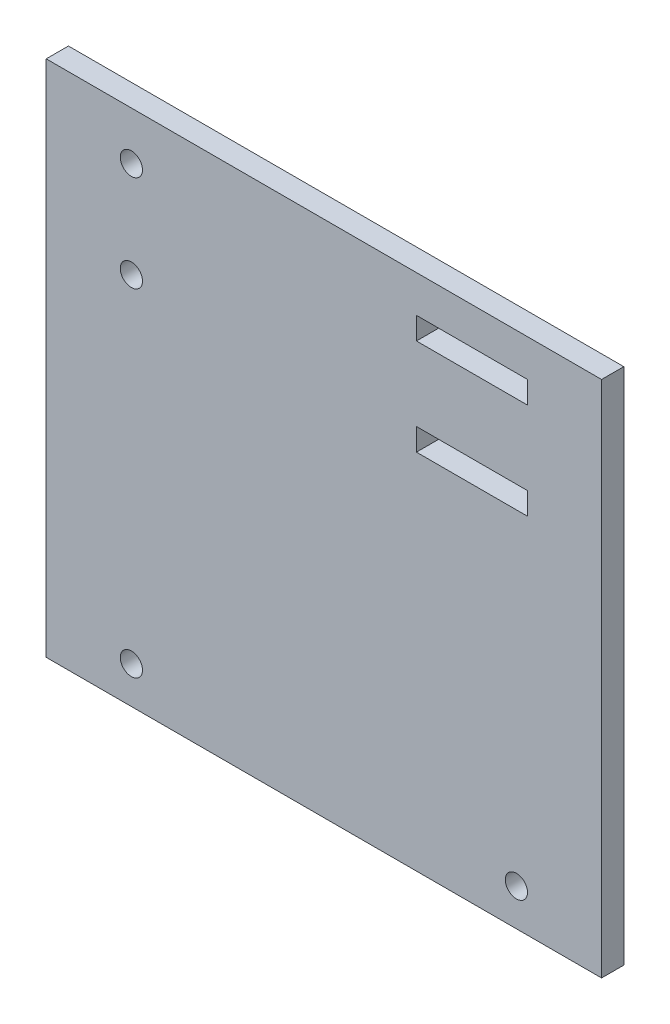
ISO-10303-21;
HEADER;
FILE_DESCRIPTION(('STEP AP214'),'2;1');
FILE_NAME('part.step','',(''),(''),'','','');
FILE_SCHEMA(('AUTOMOTIVE_DESIGN { 1 0 10303 214 1 1 1 1 }'));
ENDSEC;
DATA;
#1=APPLICATION_CONTEXT('core data for automotive mechanical design processes');
#2=APPLICATION_PROTOCOL_DEFINITION('international standard','automotive_design',2000,#1);
#3=PRODUCT_CONTEXT('',#1,'mechanical');
#4=PRODUCT('Part','Part','',(#3));
#5=PRODUCT_RELATED_PRODUCT_CATEGORY('part','',(#4));
#6=PRODUCT_DEFINITION_FORMATION('','',#4);
#7=PRODUCT_DEFINITION_CONTEXT('part definition',#1,'design');
#8=PRODUCT_DEFINITION('design','',#6,#7);
#9=PRODUCT_DEFINITION_SHAPE('','',#8);
#10=(LENGTH_UNIT() NAMED_UNIT(*) SI_UNIT(.MILLI.,.METRE.));
#11=(NAMED_UNIT(*) PLANE_ANGLE_UNIT() SI_UNIT($,.RADIAN.));
#12=(NAMED_UNIT(*) SI_UNIT($,.STERADIAN.) SOLID_ANGLE_UNIT());
#13=UNCERTAINTY_MEASURE_WITH_UNIT(LENGTH_MEASURE(1.E-05),#10,'distance_accuracy_value','');
#14=(GEOMETRIC_REPRESENTATION_CONTEXT(3) GLOBAL_UNCERTAINTY_ASSIGNED_CONTEXT((#13)) GLOBAL_UNIT_ASSIGNED_CONTEXT((#10,
#11,#12)) REPRESENTATION_CONTEXT('',''));
#15=CARTESIAN_POINT('',(0.,0.,0.));
#16=DIRECTION('',(0.,0.,1.));
#17=DIRECTION('',(1.,0.,0.));
#18=AXIS2_PLACEMENT_3D('',#15,#16,#17);
#19=CARTESIAN_POINT('',(0.,0.,3.));
#20=DIRECTION('',(0.,0.,1.));
#21=DIRECTION('',(1.,0.,0.));
#22=AXIS2_PLACEMENT_3D('',#19,#20,#21);
#23=PLANE('',#22);
#24=CARTESIAN_POINT('',(13.3163265306122,-32.8367346938776,3.));
#25=DIRECTION('',(0.,0.,1.));
#26=DIRECTION('',(1.,0.,0.));
#27=AXIS2_PLACEMENT_3D('',#24,#25,#26);
#28=CIRCLE('',#27,1.50000000000002);
#29=CARTESIAN_POINT('',(14.8163265306122,-32.8367346938776,3.));
#30=VERTEX_POINT('',#29);
#31=EDGE_CURVE('E160',#30,#30,#28,.T.);
#32=ORIENTED_EDGE('',*,*,#31,.F.);
#33=EDGE_LOOP('',(#32));
#34=FACE_BOUND('',#33,.T.);
#35=DIRECTION('',(1.,0.,0.));
#36=VECTOR('',#35,1.);
#37=CARTESIAN_POINT('',(-0.18367346938776,24.1632653061225,3.));
#38=LINE('',#37,#36);
#39=CARTESIAN_POINT('',(-0.18367346938776,24.1632653061225,3.));
#40=VERTEX_POINT('',#39);
#41=CARTESIAN_POINT('',(14.8163265306122,24.1632653061225,3.));
#42=VERTEX_POINT('',#41);
#43=EDGE_CURVE('E174',#40,#42,#38,.T.);
#44=ORIENTED_EDGE('',*,*,#43,.F.);
#45=DIRECTION('',(0.,-1.,0.));
#46=VECTOR('',#45,1.);
#47=CARTESIAN_POINT('',(-0.18367346938776,27.1632653061225,3.));
#48=LINE('',#47,#46);
#49=CARTESIAN_POINT('',(-0.18367346938776,27.1632653061225,3.));
#50=VERTEX_POINT('',#49);
#51=EDGE_CURVE('E172',#50,#40,#48,.T.);
#52=ORIENTED_EDGE('',*,*,#51,.F.);
#53=DIRECTION('',(-1.,0.,0.));
#54=VECTOR('',#53,1.);
#55=CARTESIAN_POINT('',(-0.18367346938776,27.1632653061225,3.));
#56=LINE('',#55,#54);
#57=CARTESIAN_POINT('',(14.8163265306122,27.1632653061225,3.));
#58=VERTEX_POINT('',#57);
#59=EDGE_CURVE('E180',#58,#50,#56,.T.);
#60=ORIENTED_EDGE('',*,*,#59,.F.);
#61=DIRECTION('',(0.,1.,0.));
#62=VECTOR('',#61,1.);
#63=CARTESIAN_POINT('',(14.8163265306122,27.1632653061225,3.));
#64=LINE('',#63,#62);
#65=EDGE_CURVE('E177',#42,#58,#64,.T.);
#66=ORIENTED_EDGE('',*,*,#65,.F.);
#67=EDGE_LOOP('',(#44,#52,#60,#66));
#68=FACE_BOUND('',#67,.T.);
#69=CARTESIAN_POINT('',(-38.6836734693878,25.6632653061225,3.));
#70=DIRECTION('',(0.,0.,1.));
#71=DIRECTION('',(1.,0.,0.));
#72=AXIS2_PLACEMENT_3D('',#69,#70,#71);
#73=CIRCLE('',#72,1.5);
#74=CARTESIAN_POINT('',(-37.1836734693878,25.6632653061225,3.));
#75=VERTEX_POINT('',#74);
#76=EDGE_CURVE('E209',#75,#75,#73,.T.);
#77=ORIENTED_EDGE('',*,*,#76,.F.);
#78=EDGE_LOOP('',(#77));
#79=FACE_BOUND('',#78,.T.);
#80=DIRECTION('',(0.,-1.,0.));
#81=VECTOR('',#80,1.);
#82=CARTESIAN_POINT('',(-50.1836734693878,32.1632653061225,3.));
#83=LINE('',#82,#81);
#84=CARTESIAN_POINT('',(-50.1836734693878,32.1632653061225,3.));
#85=VERTEX_POINT('',#84);
#86=CARTESIAN_POINT('',(-50.1836734693878,-37.8367346938776,3.));
#87=VERTEX_POINT('',#86);
#88=EDGE_CURVE('E215',#85,#87,#83,.T.);
#89=ORIENTED_EDGE('',*,*,#88,.T.);
#90=DIRECTION('',(1.,0.,0.));
#91=VECTOR('',#90,1.);
#92=CARTESIAN_POINT('',(-50.1836734693878,-37.8367346938776,3.));
#93=LINE('',#92,#91);
#94=CARTESIAN_POINT('',(24.8163265306122,-37.8367346938776,3.));
#95=VERTEX_POINT('',#94);
#96=EDGE_CURVE('E218',#87,#95,#93,.T.);
#97=ORIENTED_EDGE('',*,*,#96,.T.);
#98=DIRECTION('',(0.,1.,0.));
#99=VECTOR('',#98,1.);
#100=CARTESIAN_POINT('',(24.8163265306122,32.1632653061225,3.));
#101=LINE('',#100,#99);
#102=CARTESIAN_POINT('',(24.8163265306122,32.1632653061225,3.));
#103=VERTEX_POINT('',#102);
#104=EDGE_CURVE('E221',#95,#103,#101,.T.);
#105=ORIENTED_EDGE('',*,*,#104,.T.);
#106=DIRECTION('',(-1.,0.,0.));
#107=VECTOR('',#106,1.);
#108=CARTESIAN_POINT('',(-50.1836734693878,32.1632653061225,3.));
#109=LINE('',#108,#107);
#110=EDGE_CURVE('E223',#103,#85,#109,.T.);
#111=ORIENTED_EDGE('',*,*,#110,.T.);
#112=EDGE_LOOP('',(#89,#97,#105,#111));
#113=FACE_BOUND('',#112,.T.);
#114=CARTESIAN_POINT('',(-38.6836734693878,12.6632653061225,3.));
#115=DIRECTION('',(0.,0.,1.));
#116=DIRECTION('',(1.,0.,0.));
#117=AXIS2_PLACEMENT_3D('',#114,#115,#116);
#118=CIRCLE('',#117,1.5);
#119=CARTESIAN_POINT('',(-37.1836734693878,12.6632653061225,3.));
#120=VERTEX_POINT('',#119);
#121=EDGE_CURVE('E203',#120,#120,#118,.T.);
#122=ORIENTED_EDGE('',*,*,#121,.F.);
#123=EDGE_LOOP('',(#122));
#124=FACE_BOUND('',#123,.T.);
#125=CARTESIAN_POINT('',(-38.6836734693878,-32.8367346938776,3.));
#126=DIRECTION('',(0.,0.,1.));
#127=DIRECTION('',(1.,0.,0.));
#128=AXIS2_PLACEMENT_3D('',#125,#126,#127);
#129=CIRCLE('',#128,1.5);
#130=CARTESIAN_POINT('',(-37.1836734693878,-32.8367346938776,3.));
#131=VERTEX_POINT('',#130);
#132=EDGE_CURVE('E166',#131,#131,#129,.T.);
#133=ORIENTED_EDGE('',*,*,#132,.F.);
#134=EDGE_LOOP('',(#133));
#135=FACE_BOUND('',#134,.T.);
#136=DIRECTION('',(1.,0.,0.));
#137=VECTOR('',#136,1.);
#138=CARTESIAN_POINT('',(-0.183673469387754,11.1632653061225,3.));
#139=LINE('',#138,#137);
#140=CARTESIAN_POINT('',(-0.183673469387754,11.1632653061225,3.));
#141=VERTEX_POINT('',#140);
#142=CARTESIAN_POINT('',(14.8163265306122,11.1632653061225,3.));
#143=VERTEX_POINT('',#142);
#144=EDGE_CURVE('E132',#141,#143,#139,.T.);
#145=ORIENTED_EDGE('',*,*,#144,.F.);
#146=DIRECTION('',(0.,-1.,0.));
#147=VECTOR('',#146,1.);
#148=CARTESIAN_POINT('',(-0.183673469387754,14.1632653061225,3.));
#149=LINE('',#148,#147);
#150=CARTESIAN_POINT('',(-0.183673469387754,14.1632653061225,3.));
#151=VERTEX_POINT('',#150);
#152=EDGE_CURVE('E124',#151,#141,#149,.T.);
#153=ORIENTED_EDGE('',*,*,#152,.F.);
#154=DIRECTION('',(-1.,0.,0.));
#155=VECTOR('',#154,1.);
#156=CARTESIAN_POINT('',(-0.183673469387754,14.1632653061225,3.));
#157=LINE('',#156,#155);
#158=CARTESIAN_POINT('',(14.8163265306122,14.1632653061225,3.));
#159=VERTEX_POINT('',#158);
#160=EDGE_CURVE('E146',#159,#151,#157,.T.);
#161=ORIENTED_EDGE('',*,*,#160,.F.);
#162=DIRECTION('',(0.,1.,0.));
#163=VECTOR('',#162,1.);
#164=CARTESIAN_POINT('',(14.8163265306122,14.1632653061225,3.));
#165=LINE('',#164,#163);
#166=EDGE_CURVE('E144',#143,#159,#165,.T.);
#167=ORIENTED_EDGE('',*,*,#166,.F.);
#168=EDGE_LOOP('',(#145,#153,#161,#167));
#169=FACE_BOUND('',#168,.T.);
#170=ADVANCED_FACE('F35',(#34,#68,#79,#113,#124,#135,#169),#23,.T.);
#171=CARTESIAN_POINT('',(0.,0.,0.));
#172=DIRECTION('',(0.,0.,1.));
#173=DIRECTION('',(1.,0.,0.));
#174=AXIS2_PLACEMENT_3D('',#171,#172,#173);
#175=PLANE('',#174);
#176=CARTESIAN_POINT('',(13.3163265306122,-32.8367346938776,0.));
#177=DIRECTION('',(0.,0.,1.));
#178=DIRECTION('',(1.,0.,0.));
#179=AXIS2_PLACEMENT_3D('',#176,#177,#178);
#180=CIRCLE('',#179,1.50000000000002);
#181=CARTESIAN_POINT('',(14.8163265306122,-32.8367346938776,0.));
#182=VERTEX_POINT('',#181);
#183=EDGE_CURVE('E140',#182,#182,#180,.T.);
#184=ORIENTED_EDGE('',*,*,#183,.T.);
#185=EDGE_LOOP('',(#184));
#186=FACE_BOUND('',#185,.T.);
#187=DIRECTION('',(0.,-1.,0.));
#188=VECTOR('',#187,1.);
#189=CARTESIAN_POINT('',(-0.18367346938776,27.1632653061225,0.));
#190=LINE('',#189,#188);
#191=CARTESIAN_POINT('',(-0.18367346938776,27.1632653061225,0.));
#192=VERTEX_POINT('',#191);
#193=CARTESIAN_POINT('',(-0.18367346938776,24.1632653061225,0.));
#194=VERTEX_POINT('',#193);
#195=EDGE_CURVE('E169',#192,#194,#190,.T.);
#196=ORIENTED_EDGE('',*,*,#195,.T.);
#197=DIRECTION('',(1.,0.,0.));
#198=VECTOR('',#197,1.);
#199=CARTESIAN_POINT('',(-0.18367346938776,24.1632653061225,0.));
#200=LINE('',#199,#198);
#201=CARTESIAN_POINT('',(14.8163265306122,24.1632653061225,0.));
#202=VERTEX_POINT('',#201);
#203=EDGE_CURVE('E185',#194,#202,#200,.T.);
#204=ORIENTED_EDGE('',*,*,#203,.T.);
#205=DIRECTION('',(0.,1.,0.));
#206=VECTOR('',#205,1.);
#207=CARTESIAN_POINT('',(14.8163265306122,27.1632653061225,0.));
#208=LINE('',#207,#206);
#209=CARTESIAN_POINT('',(14.8163265306122,27.1632653061225,0.));
#210=VERTEX_POINT('',#209);
#211=EDGE_CURVE('E188',#202,#210,#208,.T.);
#212=ORIENTED_EDGE('',*,*,#211,.T.);
#213=DIRECTION('',(-1.,0.,0.));
#214=VECTOR('',#213,1.);
#215=CARTESIAN_POINT('',(-0.18367346938776,27.1632653061225,0.));
#216=LINE('',#215,#214);
#217=EDGE_CURVE('E175',#210,#192,#216,.T.);
#218=ORIENTED_EDGE('',*,*,#217,.T.);
#219=EDGE_LOOP('',(#196,#204,#212,#218));
#220=FACE_BOUND('',#219,.T.);
#221=CARTESIAN_POINT('',(-38.6836734693878,25.6632653061225,0.));
#222=DIRECTION('',(0.,0.,1.));
#223=DIRECTION('',(1.,0.,0.));
#224=AXIS2_PLACEMENT_3D('',#221,#222,#223);
#225=CIRCLE('',#224,1.5);
#226=CARTESIAN_POINT('',(-37.1836734693878,25.6632653061225,0.));
#227=VERTEX_POINT('',#226);
#228=EDGE_CURVE('E206',#227,#227,#225,.T.);
#229=ORIENTED_EDGE('',*,*,#228,.T.);
#230=EDGE_LOOP('',(#229));
#231=FACE_BOUND('',#230,.T.);
#232=DIRECTION('',(0.,-1.,0.));
#233=VECTOR('',#232,1.);
#234=CARTESIAN_POINT('',(-50.1836734693878,32.1632653061225,0.));
#235=LINE('',#234,#233);
#236=CARTESIAN_POINT('',(-50.1836734693878,32.1632653061225,0.));
#237=VERTEX_POINT('',#236);
#238=CARTESIAN_POINT('',(-50.1836734693878,-37.8367346938776,0.));
#239=VERTEX_POINT('',#238);
#240=EDGE_CURVE('E212',#237,#239,#235,.T.);
#241=ORIENTED_EDGE('',*,*,#240,.F.);
#242=DIRECTION('',(-1.,0.,0.));
#243=VECTOR('',#242,1.);
#244=CARTESIAN_POINT('',(-50.1836734693878,32.1632653061225,0.));
#245=LINE('',#244,#243);
#246=CARTESIAN_POINT('',(24.8163265306122,32.1632653061225,0.));
#247=VERTEX_POINT('',#246);
#248=EDGE_CURVE('E219',#247,#237,#245,.T.);
#249=ORIENTED_EDGE('',*,*,#248,.F.);
#250=DIRECTION('',(0.,1.,0.));
#251=VECTOR('',#250,1.);
#252=CARTESIAN_POINT('',(24.8163265306122,32.1632653061225,0.));
#253=LINE('',#252,#251);
#254=CARTESIAN_POINT('',(24.8163265306122,-37.8367346938776,0.));
#255=VERTEX_POINT('',#254);
#256=EDGE_CURVE('E230',#255,#247,#253,.T.);
#257=ORIENTED_EDGE('',*,*,#256,.F.);
#258=DIRECTION('',(1.,0.,0.));
#259=VECTOR('',#258,1.);
#260=CARTESIAN_POINT('',(-50.1836734693878,-37.8367346938776,0.));
#261=LINE('',#260,#259);
#262=EDGE_CURVE('E228',#239,#255,#261,.T.);
#263=ORIENTED_EDGE('',*,*,#262,.F.);
#264=EDGE_LOOP('',(#241,#249,#257,#263));
#265=FACE_BOUND('',#264,.T.);
#266=CARTESIAN_POINT('',(-38.6836734693878,12.6632653061225,0.));
#267=DIRECTION('',(0.,0.,1.));
#268=DIRECTION('',(1.,0.,0.));
#269=AXIS2_PLACEMENT_3D('',#266,#267,#268);
#270=CIRCLE('',#269,1.5);
#271=CARTESIAN_POINT('',(-37.1836734693878,12.6632653061225,0.));
#272=VERTEX_POINT('',#271);
#273=EDGE_CURVE('E202',#272,#272,#270,.T.);
#274=ORIENTED_EDGE('',*,*,#273,.T.);
#275=EDGE_LOOP('',(#274));
#276=FACE_BOUND('',#275,.T.);
#277=CARTESIAN_POINT('',(-38.6836734693878,-32.8367346938776,0.));
#278=DIRECTION('',(0.,0.,1.));
#279=DIRECTION('',(1.,0.,0.));
#280=AXIS2_PLACEMENT_3D('',#277,#278,#279);
#281=CIRCLE('',#280,1.5);
#282=CARTESIAN_POINT('',(-37.1836734693878,-32.8367346938776,0.));
#283=VERTEX_POINT('',#282);
#284=EDGE_CURVE('E163',#283,#283,#281,.T.);
#285=ORIENTED_EDGE('',*,*,#284,.T.);
#286=EDGE_LOOP('',(#285));
#287=FACE_BOUND('',#286,.T.);
#288=DIRECTION('',(0.,-1.,0.));
#289=VECTOR('',#288,1.);
#290=CARTESIAN_POINT('',(-0.183673469387754,14.1632653061225,0.));
#291=LINE('',#290,#289);
#292=CARTESIAN_POINT('',(-0.183673469387754,14.1632653061225,0.));
#293=VERTEX_POINT('',#292);
#294=CARTESIAN_POINT('',(-0.183673469387754,11.1632653061225,0.));
#295=VERTEX_POINT('',#294);
#296=EDGE_CURVE('E58',#293,#295,#291,.T.);
#297=ORIENTED_EDGE('',*,*,#296,.T.);
#298=DIRECTION('',(1.,0.,0.));
#299=VECTOR('',#298,1.);
#300=CARTESIAN_POINT('',(-0.183673469387754,11.1632653061225,0.));
#301=LINE('',#300,#299);
#302=CARTESIAN_POINT('',(14.8163265306122,11.1632653061225,0.));
#303=VERTEX_POINT('',#302);
#304=EDGE_CURVE('E139',#295,#303,#301,.T.);
#305=ORIENTED_EDGE('',*,*,#304,.T.);
#306=DIRECTION('',(0.,1.,0.));
#307=VECTOR('',#306,1.);
#308=CARTESIAN_POINT('',(14.8163265306122,14.1632653061225,0.));
#309=LINE('',#308,#307);
#310=CARTESIAN_POINT('',(14.8163265306122,14.1632653061225,0.));
#311=VERTEX_POINT('',#310);
#312=EDGE_CURVE('E152',#303,#311,#309,.T.);
#313=ORIENTED_EDGE('',*,*,#312,.T.);
#314=DIRECTION('',(-1.,0.,0.));
#315=VECTOR('',#314,1.);
#316=CARTESIAN_POINT('',(-0.183673469387754,14.1632653061225,0.));
#317=LINE('',#316,#315);
#318=EDGE_CURVE('E133',#311,#293,#317,.T.);
#319=ORIENTED_EDGE('',*,*,#318,.T.);
#320=EDGE_LOOP('',(#297,#305,#313,#319));
#321=FACE_BOUND('',#320,.T.);
#322=ADVANCED_FACE('F248',(#186,#220,#231,#265,#276,#287,#321),#175,.F.);
#323=CARTESIAN_POINT('',(-50.1836734693878,32.1632653061225,3.));
#324=DIRECTION('',(1.,0.,0.));
#325=DIRECTION('',(0.,1.,0.));
#326=AXIS2_PLACEMENT_3D('',#323,#324,#325);
#327=PLANE('',#326);
#328=ORIENTED_EDGE('',*,*,#240,.T.);
#329=DIRECTION('',(0.,0.,-1.));
#330=VECTOR('',#329,1.);
#331=CARTESIAN_POINT('',(-50.1836734693878,-37.8367346938776,3.));
#332=LINE('',#331,#330);
#333=EDGE_CURVE('E11',#87,#239,#332,.T.);
#334=ORIENTED_EDGE('',*,*,#333,.F.);
#335=ORIENTED_EDGE('',*,*,#88,.F.);
#336=DIRECTION('',(0.,0.,-1.));
#337=VECTOR('',#336,1.);
#338=CARTESIAN_POINT('',(-50.1836734693878,32.1632653061225,3.));
#339=LINE('',#338,#337);
#340=EDGE_CURVE('E225',#85,#237,#339,.T.);
#341=ORIENTED_EDGE('',*,*,#340,.T.);
#342=EDGE_LOOP('',(#328,#334,#335,#341));
#343=FACE_BOUND('',#342,.T.);
#344=ADVANCED_FACE('F37',(#343),#327,.F.);
#345=CARTESIAN_POINT('',(-50.1836734693878,-37.8367346938776,3.));
#346=DIRECTION('',(0.,1.,0.));
#347=DIRECTION('',(0.,0.,1.));
#348=AXIS2_PLACEMENT_3D('',#345,#346,#347);
#349=PLANE('',#348);
#350=ORIENTED_EDGE('',*,*,#262,.T.);
#351=DIRECTION('',(0.,0.,-1.));
#352=VECTOR('',#351,1.);
#353=CARTESIAN_POINT('',(24.8163265306122,-37.8367346938776,3.));
#354=LINE('',#353,#352);
#355=EDGE_CURVE('E43',#95,#255,#354,.T.);
#356=ORIENTED_EDGE('',*,*,#355,.F.);
#357=ORIENTED_EDGE('',*,*,#96,.F.);
#358=ORIENTED_EDGE('',*,*,#333,.T.);
#359=EDGE_LOOP('',(#350,#356,#357,#358));
#360=FACE_BOUND('',#359,.T.);
#361=ADVANCED_FACE('F259',(#360),#349,.F.);
#362=CARTESIAN_POINT('',(24.8163265306122,32.1632653061225,3.));
#363=DIRECTION('',(-1.,0.,0.));
#364=DIRECTION('',(0.,-1.,0.));
#365=AXIS2_PLACEMENT_3D('',#362,#363,#364);
#366=PLANE('',#365);
#367=ORIENTED_EDGE('',*,*,#256,.T.);
#368=DIRECTION('',(0.,0.,-1.));
#369=VECTOR('',#368,1.);
#370=CARTESIAN_POINT('',(24.8163265306122,32.1632653061225,3.));
#371=LINE('',#370,#369);
#372=EDGE_CURVE('E235',#103,#247,#371,.T.);
#373=ORIENTED_EDGE('',*,*,#372,.F.);
#374=ORIENTED_EDGE('',*,*,#104,.F.);
#375=ORIENTED_EDGE('',*,*,#355,.T.);
#376=EDGE_LOOP('',(#367,#373,#374,#375));
#377=FACE_BOUND('',#376,.T.);
#378=ADVANCED_FACE('F242',(#377),#366,.F.);
#379=CARTESIAN_POINT('',(-50.1836734693878,32.1632653061225,3.));
#380=DIRECTION('',(0.,-1.,0.));
#381=DIRECTION('',(0.,0.,-1.));
#382=AXIS2_PLACEMENT_3D('',#379,#380,#381);
#383=PLANE('',#382);
#384=ORIENTED_EDGE('',*,*,#248,.T.);
#385=ORIENTED_EDGE('',*,*,#340,.F.);
#386=ORIENTED_EDGE('',*,*,#110,.F.);
#387=ORIENTED_EDGE('',*,*,#372,.T.);
#388=EDGE_LOOP('',(#384,#385,#386,#387));
#389=FACE_BOUND('',#388,.T.);
#390=ADVANCED_FACE('F252',(#389),#383,.F.);
#391=CARTESIAN_POINT('',(-38.6836734693878,25.6632653061225,3.));
#392=DIRECTION('',(0.,0.,-1.));
#393=DIRECTION('',(-1.,0.,0.));
#394=AXIS2_PLACEMENT_3D('',#391,#392,#393);
#395=CYLINDRICAL_SURFACE('',#394,1.5);
#396=ORIENTED_EDGE('',*,*,#76,.T.);
#397=EDGE_LOOP('',(#396));
#398=FACE_BOUND('',#397,.T.);
#399=ORIENTED_EDGE('',*,*,#228,.F.);
#400=EDGE_LOOP('',(#399));
#401=FACE_BOUND('',#400,.T.);
#402=ADVANCED_FACE('F277',(#398,#401),#395,.F.);
#403=CARTESIAN_POINT('',(-38.6836734693878,12.6632653061225,3.));
#404=DIRECTION('',(0.,0.,-1.));
#405=DIRECTION('',(-1.,0.,0.));
#406=AXIS2_PLACEMENT_3D('',#403,#404,#405);
#407=CYLINDRICAL_SURFACE('',#406,1.5);
#408=ORIENTED_EDGE('',*,*,#121,.T.);
#409=EDGE_LOOP('',(#408));
#410=FACE_BOUND('',#409,.T.);
#411=ORIENTED_EDGE('',*,*,#273,.F.);
#412=EDGE_LOOP('',(#411));
#413=FACE_BOUND('',#412,.T.);
#414=ADVANCED_FACE('F284',(#410,#413),#407,.F.);
#415=CARTESIAN_POINT('',(-0.18367346938776,27.1632653061225,3.));
#416=DIRECTION('',(1.,0.,0.));
#417=DIRECTION('',(0.,1.,0.));
#418=AXIS2_PLACEMENT_3D('',#415,#416,#417);
#419=PLANE('',#418);
#420=ORIENTED_EDGE('',*,*,#195,.F.);
#421=DIRECTION('',(0.,0.,-1.));
#422=VECTOR('',#421,1.);
#423=CARTESIAN_POINT('',(-0.18367346938776,27.1632653061225,3.));
#424=LINE('',#423,#422);
#425=EDGE_CURVE('E182',#50,#192,#424,.T.);
#426=ORIENTED_EDGE('',*,*,#425,.F.);
#427=ORIENTED_EDGE('',*,*,#51,.T.);
#428=DIRECTION('',(0.,0.,-1.));
#429=VECTOR('',#428,1.);
#430=CARTESIAN_POINT('',(-0.18367346938776,24.1632653061225,3.));
#431=LINE('',#430,#429);
#432=EDGE_CURVE('E199',#40,#194,#431,.T.);
#433=ORIENTED_EDGE('',*,*,#432,.T.);
#434=EDGE_LOOP('',(#420,#426,#427,#433));
#435=FACE_BOUND('',#434,.T.);
#436=ADVANCED_FACE('F289',(#435),#419,.T.);
#437=CARTESIAN_POINT('',(-0.18367346938776,24.1632653061225,3.));
#438=DIRECTION('',(0.,1.,0.));
#439=DIRECTION('',(0.,0.,1.));
#440=AXIS2_PLACEMENT_3D('',#437,#438,#439);
#441=PLANE('',#440);
#442=ORIENTED_EDGE('',*,*,#203,.F.);
#443=ORIENTED_EDGE('',*,*,#432,.F.);
#444=ORIENTED_EDGE('',*,*,#43,.T.);
#445=DIRECTION('',(0.,0.,-1.));
#446=VECTOR('',#445,1.);
#447=CARTESIAN_POINT('',(14.8163265306122,24.1632653061225,3.));
#448=LINE('',#447,#446);
#449=EDGE_CURVE('E197',#42,#202,#448,.T.);
#450=ORIENTED_EDGE('',*,*,#449,.T.);
#451=EDGE_LOOP('',(#442,#443,#444,#450));
#452=FACE_BOUND('',#451,.T.);
#453=ADVANCED_FACE('F299',(#452),#441,.T.);
#454=CARTESIAN_POINT('',(14.8163265306122,27.1632653061225,3.));
#455=DIRECTION('',(-1.,0.,0.));
#456=DIRECTION('',(0.,0.,1.));
#457=AXIS2_PLACEMENT_3D('',#454,#455,#456);
#458=PLANE('',#457);
#459=ORIENTED_EDGE('',*,*,#211,.F.);
#460=ORIENTED_EDGE('',*,*,#449,.F.);
#461=ORIENTED_EDGE('',*,*,#65,.T.);
#462=DIRECTION('',(0.,0.,-1.));
#463=VECTOR('',#462,1.);
#464=CARTESIAN_POINT('',(14.8163265306122,27.1632653061225,3.));
#465=LINE('',#464,#463);
#466=EDGE_CURVE('E195',#58,#210,#465,.T.);
#467=ORIENTED_EDGE('',*,*,#466,.T.);
#468=EDGE_LOOP('',(#459,#460,#461,#467));
#469=FACE_BOUND('',#468,.T.);
#470=ADVANCED_FACE('F306',(#469),#458,.T.);
#471=CARTESIAN_POINT('',(-0.18367346938776,27.1632653061225,3.));
#472=DIRECTION('',(0.,-1.,0.));
#473=DIRECTION('',(0.,0.,-1.));
#474=AXIS2_PLACEMENT_3D('',#471,#472,#473);
#475=PLANE('',#474);
#476=ORIENTED_EDGE('',*,*,#217,.F.);
#477=ORIENTED_EDGE('',*,*,#466,.F.);
#478=ORIENTED_EDGE('',*,*,#59,.T.);
#479=ORIENTED_EDGE('',*,*,#425,.T.);
#480=EDGE_LOOP('',(#476,#477,#478,#479));
#481=FACE_BOUND('',#480,.T.);
#482=ADVANCED_FACE('F310',(#481),#475,.T.);
#483=CARTESIAN_POINT('',(-38.6836734693878,-32.8367346938776,3.));
#484=DIRECTION('',(0.,0.,-1.));
#485=DIRECTION('',(-1.,0.,0.));
#486=AXIS2_PLACEMENT_3D('',#483,#484,#485);
#487=CYLINDRICAL_SURFACE('',#486,1.5);
#488=ORIENTED_EDGE('',*,*,#132,.T.);
#489=EDGE_LOOP('',(#488));
#490=FACE_BOUND('',#489,.T.);
#491=ORIENTED_EDGE('',*,*,#284,.F.);
#492=EDGE_LOOP('',(#491));
#493=FACE_BOUND('',#492,.T.);
#494=ADVANCED_FACE('F314',(#490,#493),#487,.F.);
#495=CARTESIAN_POINT('',(13.3163265306122,-32.8367346938776,3.));
#496=DIRECTION('',(0.,0.,-1.));
#497=DIRECTION('',(-1.,0.,0.));
#498=AXIS2_PLACEMENT_3D('',#495,#496,#497);
#499=CYLINDRICAL_SURFACE('',#498,1.50000000000002);
#500=ORIENTED_EDGE('',*,*,#31,.T.);
#501=EDGE_LOOP('',(#500));
#502=FACE_BOUND('',#501,.T.);
#503=ORIENTED_EDGE('',*,*,#183,.F.);
#504=EDGE_LOOP('',(#503));
#505=FACE_BOUND('',#504,.T.);
#506=ADVANCED_FACE('F318',(#502,#505),#499,.F.);
#507=CARTESIAN_POINT('',(-0.183673469387754,14.1632653061225,3.));
#508=DIRECTION('',(1.,0.,0.));
#509=DIRECTION('',(0.,1.,0.));
#510=AXIS2_PLACEMENT_3D('',#507,#508,#509);
#511=PLANE('',#510);
#512=ORIENTED_EDGE('',*,*,#296,.F.);
#513=DIRECTION('',(0.,0.,-1.));
#514=VECTOR('',#513,1.);
#515=CARTESIAN_POINT('',(-0.183673469387754,14.1632653061225,3.));
#516=LINE('',#515,#514);
#517=EDGE_CURVE('E128',#151,#293,#516,.T.);
#518=ORIENTED_EDGE('',*,*,#517,.F.);
#519=ORIENTED_EDGE('',*,*,#152,.T.);
#520=DIRECTION('',(0.,0.,-1.));
#521=VECTOR('',#520,1.);
#522=CARTESIAN_POINT('',(-0.183673469387754,11.1632653061225,3.));
#523=LINE('',#522,#521);
#524=EDGE_CURVE('E127',#141,#295,#523,.T.);
#525=ORIENTED_EDGE('',*,*,#524,.T.);
#526=EDGE_LOOP('',(#512,#518,#519,#525));
#527=FACE_BOUND('',#526,.T.);
#528=ADVANCED_FACE('F126',(#527),#511,.T.);
#529=CARTESIAN_POINT('',(-0.183673469387754,11.1632653061225,3.));
#530=DIRECTION('',(0.,1.,0.));
#531=DIRECTION('',(0.,0.,1.));
#532=AXIS2_PLACEMENT_3D('',#529,#530,#531);
#533=PLANE('',#532);
#534=ORIENTED_EDGE('',*,*,#304,.F.);
#535=ORIENTED_EDGE('',*,*,#524,.F.);
#536=ORIENTED_EDGE('',*,*,#144,.T.);
#537=DIRECTION('',(0.,0.,-1.));
#538=VECTOR('',#537,1.);
#539=CARTESIAN_POINT('',(14.8163265306122,11.1632653061225,3.));
#540=LINE('',#539,#538);
#541=EDGE_CURVE('E141',#143,#303,#540,.T.);
#542=ORIENTED_EDGE('',*,*,#541,.T.);
#543=EDGE_LOOP('',(#534,#535,#536,#542));
#544=FACE_BOUND('',#543,.T.);
#545=ADVANCED_FACE('F136',(#544),#533,.T.);
#546=CARTESIAN_POINT('',(14.8163265306122,14.1632653061225,3.));
#547=DIRECTION('',(-1.,0.,0.));
#548=DIRECTION('',(0.,0.,1.));
#549=AXIS2_PLACEMENT_3D('',#546,#547,#548);
#550=PLANE('',#549);
#551=ORIENTED_EDGE('',*,*,#312,.F.);
#552=ORIENTED_EDGE('',*,*,#541,.F.);
#553=ORIENTED_EDGE('',*,*,#166,.T.);
#554=DIRECTION('',(0.,0.,-1.));
#555=VECTOR('',#554,1.);
#556=CARTESIAN_POINT('',(14.8163265306122,14.1632653061225,3.));
#557=LINE('',#556,#555);
#558=EDGE_CURVE('E50',#159,#311,#557,.T.);
#559=ORIENTED_EDGE('',*,*,#558,.T.);
#560=EDGE_LOOP('',(#551,#552,#553,#559));
#561=FACE_BOUND('',#560,.T.);
#562=ADVANCED_FACE('F327',(#561),#550,.T.);
#563=CARTESIAN_POINT('',(-0.183673469387754,14.1632653061225,3.));
#564=DIRECTION('',(0.,-1.,0.));
#565=DIRECTION('',(0.,0.,-1.));
#566=AXIS2_PLACEMENT_3D('',#563,#564,#565);
#567=PLANE('',#566);
#568=ORIENTED_EDGE('',*,*,#318,.F.);
#569=ORIENTED_EDGE('',*,*,#558,.F.);
#570=ORIENTED_EDGE('',*,*,#160,.T.);
#571=ORIENTED_EDGE('',*,*,#517,.T.);
#572=EDGE_LOOP('',(#568,#569,#570,#571));
#573=FACE_BOUND('',#572,.T.);
#574=ADVANCED_FACE('F330',(#573),#567,.T.);
#575=CLOSED_SHELL('',(#170,#322,#344,#361,#378,#390,#402,#414,#436,#453,#470,#482,#494,#506,
#528,#545,#562,#574));
#576=MANIFOLD_SOLID_BREP('B2',#575);
#577=ADVANCED_BREP_SHAPE_REPRESENTATION('',(#18,#576),#14);
#578=SHAPE_DEFINITION_REPRESENTATION(#9,#577);
ENDSEC;
END-ISO-10303-21;
